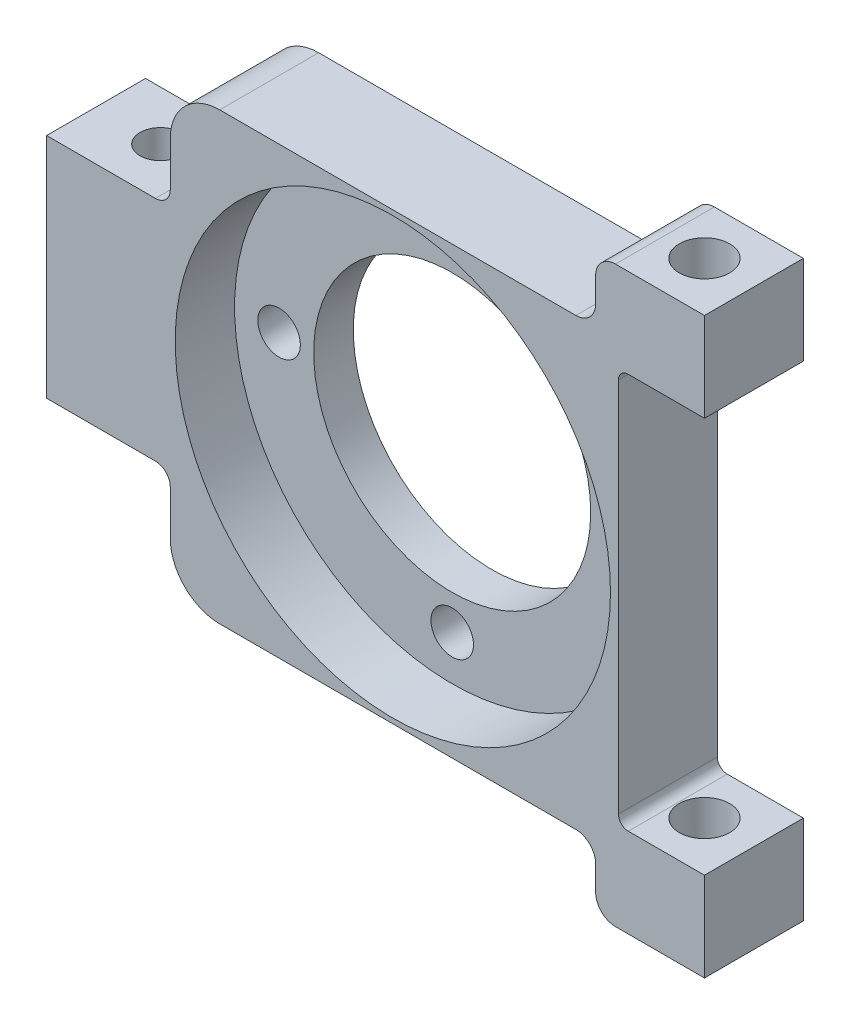
ISO-10303-21;
HEADER;
FILE_DESCRIPTION(('STEP AP214'),'2;1');
FILE_NAME('part.step','',(''),(''),'','','');
FILE_SCHEMA(('AUTOMOTIVE_DESIGN { 1 0 10303 214 1 1 1 1 }'));
ENDSEC;
DATA;
#1=APPLICATION_CONTEXT('core data for automotive mechanical design processes');
#2=APPLICATION_PROTOCOL_DEFINITION('international standard','automotive_design',2000,#1);
#3=PRODUCT_CONTEXT('',#1,'mechanical');
#4=PRODUCT('Part','Part','',(#3));
#5=PRODUCT_RELATED_PRODUCT_CATEGORY('part','',(#4));
#6=PRODUCT_DEFINITION_FORMATION('','',#4);
#7=PRODUCT_DEFINITION_CONTEXT('part definition',#1,'design');
#8=PRODUCT_DEFINITION('design','',#6,#7);
#9=PRODUCT_DEFINITION_SHAPE('','',#8);
#10=(LENGTH_UNIT() NAMED_UNIT(*) SI_UNIT(.MILLI.,.METRE.));
#11=(NAMED_UNIT(*) PLANE_ANGLE_UNIT() SI_UNIT($,.RADIAN.));
#12=(NAMED_UNIT(*) SI_UNIT($,.STERADIAN.) SOLID_ANGLE_UNIT());
#13=UNCERTAINTY_MEASURE_WITH_UNIT(LENGTH_MEASURE(1.E-05),#10,'distance_accuracy_value','');
#14=(GEOMETRIC_REPRESENTATION_CONTEXT(3) GLOBAL_UNCERTAINTY_ASSIGNED_CONTEXT((#13)) GLOBAL_UNIT_ASSIGNED_CONTEXT((#10,
#11,#12)) REPRESENTATION_CONTEXT('',''));
#15=CARTESIAN_POINT('',(0.,0.,0.));
#16=DIRECTION('',(0.,0.,1.));
#17=DIRECTION('',(1.,0.,0.));
#18=AXIS2_PLACEMENT_3D('',#15,#16,#17);
#19=CARTESIAN_POINT('',(26.5,-29.,5.));
#20=DIRECTION('',(0.,1.,0.));
#21=DIRECTION('',(0.,0.,1.));
#22=AXIS2_PLACEMENT_3D('',#19,#20,#21);
#23=CYLINDRICAL_SURFACE('',#22,2.55);
#24=CARTESIAN_POINT('',(26.5,-20.,5.));
#25=DIRECTION('',(0.,-1.,0.));
#26=DIRECTION('',(0.,0.,-1.));
#27=AXIS2_PLACEMENT_3D('',#24,#25,#26);
#28=CIRCLE('',#27,2.55);
#29=CARTESIAN_POINT('',(26.5,-20.,2.45));
#30=VERTEX_POINT('',#29);
#31=EDGE_CURVE('E476',#30,#30,#28,.F.);
#32=ORIENTED_EDGE('',*,*,#31,.T.);
#33=EDGE_LOOP('',(#32));
#34=FACE_BOUND('',#33,.T.);
#35=CARTESIAN_POINT('',(26.5,-29.,5.));
#36=DIRECTION('',(0.,1.,0.));
#37=DIRECTION('',(0.,0.,1.));
#38=AXIS2_PLACEMENT_3D('',#35,#36,#37);
#39=CIRCLE('',#38,2.55);
#40=CARTESIAN_POINT('',(26.5,-29.,7.55));
#41=VERTEX_POINT('',#40);
#42=EDGE_CURVE('E280',#41,#41,#39,.T.);
#43=ORIENTED_EDGE('',*,*,#42,.F.);
#44=EDGE_LOOP('',(#43));
#45=FACE_BOUND('',#44,.T.);
#46=ADVANCED_FACE('F39',(#34,#45),#23,.F.);
#47=CARTESIAN_POINT('',(31.5,-29.,0.));
#48=DIRECTION('',(-1.,0.,0.));
#49=DIRECTION('',(0.,0.,1.));
#50=AXIS2_PLACEMENT_3D('',#47,#48,#49);
#51=PLANE('',#50);
#52=DIRECTION('',(0.,1.,0.));
#53=VECTOR('',#52,1.);
#54=CARTESIAN_POINT('',(31.5,-29.,0.));
#55=LINE('',#54,#53);
#56=CARTESIAN_POINT('',(31.5,-29.,0.));
#57=VERTEX_POINT('',#56);
#58=CARTESIAN_POINT('',(31.5,-20.,0.));
#59=VERTEX_POINT('',#58);
#60=EDGE_CURVE('E218',#57,#59,#55,.T.);
#61=ORIENTED_EDGE('',*,*,#60,.T.);
#62=DIRECTION('',(0.,0.,1.));
#63=VECTOR('',#62,1.);
#64=CARTESIAN_POINT('',(31.5,-20.,0.));
#65=LINE('',#64,#63);
#66=CARTESIAN_POINT('',(31.5,-20.,10.));
#67=VERTEX_POINT('',#66);
#68=EDGE_CURVE('E229',#59,#67,#65,.T.);
#69=ORIENTED_EDGE('',*,*,#68,.T.);
#70=DIRECTION('',(0.,1.,0.));
#71=VECTOR('',#70,1.);
#72=CARTESIAN_POINT('',(31.5,-29.,10.));
#73=LINE('',#72,#71);
#74=CARTESIAN_POINT('',(31.5,-29.,10.));
#75=VERTEX_POINT('',#74);
#76=EDGE_CURVE('E247',#75,#67,#73,.T.);
#77=ORIENTED_EDGE('',*,*,#76,.F.);
#78=DIRECTION('',(0.,0.,1.));
#79=VECTOR('',#78,1.);
#80=CARTESIAN_POINT('',(31.5,-29.,0.));
#81=LINE('',#80,#79);
#82=EDGE_CURVE('E243',#57,#75,#81,.T.);
#83=ORIENTED_EDGE('',*,*,#82,.F.);
#84=EDGE_LOOP('',(#61,#69,#77,#83));
#85=FACE_BOUND('',#84,.T.);
#86=ADVANCED_FACE('F241',(#85),#51,.F.);
#87=CARTESIAN_POINT('',(17.5,0.,10.));
#88=DIRECTION('',(0.,0.,-1.));
#89=DIRECTION('',(-1.,0.,0.));
#90=AXIS2_PLACEMENT_3D('',#87,#88,#89);
#91=CYLINDRICAL_SURFACE('',#90,2.15);
#92=CARTESIAN_POINT('',(17.5,0.,0.));
#93=DIRECTION('',(0.,0.,1.));
#94=DIRECTION('',(1.,0.,0.));
#95=AXIS2_PLACEMENT_3D('',#92,#93,#94);
#96=CIRCLE('',#95,2.15);
#97=CARTESIAN_POINT('',(19.65,0.,0.));
#98=VERTEX_POINT('',#97);
#99=EDGE_CURVE('E318',#98,#98,#96,.T.);
#100=ORIENTED_EDGE('',*,*,#99,.F.);
#101=EDGE_LOOP('',(#100));
#102=FACE_BOUND('',#101,.T.);
#103=CARTESIAN_POINT('',(17.5,0.,4.));
#104=DIRECTION('',(0.,0.,1.));
#105=DIRECTION('',(1.,0.,0.));
#106=AXIS2_PLACEMENT_3D('',#103,#104,#105);
#107=CIRCLE('',#106,2.15);
#108=CARTESIAN_POINT('',(19.65,0.,4.));
#109=VERTEX_POINT('',#108);
#110=EDGE_CURVE('E303',#109,#109,#107,.T.);
#111=ORIENTED_EDGE('',*,*,#110,.T.);
#112=EDGE_LOOP('',(#111));
#113=FACE_BOUND('',#112,.T.);
#114=ADVANCED_FACE('F512',(#102,#113),#91,.F.);
#115=CARTESIAN_POINT('',(0.,0.,10.));
#116=DIRECTION('',(0.,0.,-1.));
#117=DIRECTION('',(-1.,0.,0.));
#118=AXIS2_PLACEMENT_3D('',#115,#116,#117);
#119=CYLINDRICAL_SURFACE('',#118,14.);
#120=CARTESIAN_POINT('',(0.,0.,0.));
#121=DIRECTION('',(0.,0.,1.));
#122=DIRECTION('',(1.,0.,0.));
#123=AXIS2_PLACEMENT_3D('',#120,#121,#122);
#124=CIRCLE('',#123,14.);
#125=CARTESIAN_POINT('',(14.,0.,0.));
#126=VERTEX_POINT('',#125);
#127=EDGE_CURVE('E315',#126,#126,#124,.T.);
#128=ORIENTED_EDGE('',*,*,#127,.F.);
#129=EDGE_LOOP('',(#128));
#130=FACE_BOUND('',#129,.T.);
#131=CARTESIAN_POINT('',(0.,0.,4.));
#132=DIRECTION('',(0.,0.,1.));
#133=DIRECTION('',(1.,0.,0.));
#134=AXIS2_PLACEMENT_3D('',#131,#132,#133);
#135=CIRCLE('',#134,14.);
#136=CARTESIAN_POINT('',(14.,0.,4.));
#137=VERTEX_POINT('',#136);
#138=EDGE_CURVE('E300',#137,#137,#135,.T.);
#139=ORIENTED_EDGE('',*,*,#138,.T.);
#140=EDGE_LOOP('',(#139));
#141=FACE_BOUND('',#140,.T.);
#142=ADVANCED_FACE('F866',(#130,#141),#119,.F.);
#143=CARTESIAN_POINT('',(0.,-17.5,10.));
#144=DIRECTION('',(0.,0.,-1.));
#145=DIRECTION('',(-1.,0.,0.));
#146=AXIS2_PLACEMENT_3D('',#143,#144,#145);
#147=CYLINDRICAL_SURFACE('',#146,2.15);
#148=CARTESIAN_POINT('',(0.,-17.5,0.));
#149=DIRECTION('',(0.,0.,1.));
#150=DIRECTION('',(1.,0.,0.));
#151=AXIS2_PLACEMENT_3D('',#148,#149,#150);
#152=CIRCLE('',#151,2.15);
#153=CARTESIAN_POINT('',(2.15,-17.5,0.));
#154=VERTEX_POINT('',#153);
#155=EDGE_CURVE('E312',#154,#154,#152,.T.);
#156=ORIENTED_EDGE('',*,*,#155,.F.);
#157=EDGE_LOOP('',(#156));
#158=FACE_BOUND('',#157,.T.);
#159=CARTESIAN_POINT('',(0.,-17.5,4.));
#160=DIRECTION('',(0.,0.,1.));
#161=DIRECTION('',(1.,0.,0.));
#162=AXIS2_PLACEMENT_3D('',#159,#160,#161);
#163=CIRCLE('',#162,2.15);
#164=CARTESIAN_POINT('',(2.15,-17.5,4.));
#165=VERTEX_POINT('',#164);
#166=EDGE_CURVE('E297',#165,#165,#163,.T.);
#167=ORIENTED_EDGE('',*,*,#166,.T.);
#168=EDGE_LOOP('',(#167));
#169=FACE_BOUND('',#168,.T.);
#170=ADVANCED_FACE('F856',(#158,#169),#147,.F.);
#171=CARTESIAN_POINT('',(-17.5,0.,10.));
#172=DIRECTION('',(0.,0.,-1.));
#173=DIRECTION('',(-1.,0.,0.));
#174=AXIS2_PLACEMENT_3D('',#171,#172,#173);
#175=CYLINDRICAL_SURFACE('',#174,2.15);
#176=CARTESIAN_POINT('',(-17.5,0.,0.));
#177=DIRECTION('',(0.,0.,1.));
#178=DIRECTION('',(1.,0.,0.));
#179=AXIS2_PLACEMENT_3D('',#176,#177,#178);
#180=CIRCLE('',#179,2.15);
#181=CARTESIAN_POINT('',(-15.35,0.,0.));
#182=VERTEX_POINT('',#181);
#183=EDGE_CURVE('E309',#182,#182,#180,.T.);
#184=ORIENTED_EDGE('',*,*,#183,.F.);
#185=EDGE_LOOP('',(#184));
#186=FACE_BOUND('',#185,.T.);
#187=CARTESIAN_POINT('',(-17.5,0.,4.));
#188=DIRECTION('',(0.,0.,1.));
#189=DIRECTION('',(1.,0.,0.));
#190=AXIS2_PLACEMENT_3D('',#187,#188,#189);
#191=CIRCLE('',#190,2.15);
#192=CARTESIAN_POINT('',(-15.35,0.,4.));
#193=VERTEX_POINT('',#192);
#194=EDGE_CURVE('E294',#193,#193,#191,.T.);
#195=ORIENTED_EDGE('',*,*,#194,.T.);
#196=EDGE_LOOP('',(#195));
#197=FACE_BOUND('',#196,.T.);
#198=ADVANCED_FACE('F846',(#186,#197),#175,.F.);
#199=CARTESIAN_POINT('',(0.,17.5,10.));
#200=DIRECTION('',(0.,0.,-1.));
#201=DIRECTION('',(-1.,0.,0.));
#202=AXIS2_PLACEMENT_3D('',#199,#200,#201);
#203=CYLINDRICAL_SURFACE('',#202,2.15);
#204=CARTESIAN_POINT('',(0.,17.5,0.));
#205=DIRECTION('',(0.,0.,1.));
#206=DIRECTION('',(1.,0.,0.));
#207=AXIS2_PLACEMENT_3D('',#204,#205,#206);
#208=CIRCLE('',#207,2.15);
#209=CARTESIAN_POINT('',(2.15000000000001,17.5,0.));
#210=VERTEX_POINT('',#209);
#211=EDGE_CURVE('E306',#210,#210,#208,.T.);
#212=ORIENTED_EDGE('',*,*,#211,.F.);
#213=EDGE_LOOP('',(#212));
#214=FACE_BOUND('',#213,.T.);
#215=CARTESIAN_POINT('',(0.,17.5,4.));
#216=DIRECTION('',(0.,0.,1.));
#217=DIRECTION('',(1.,0.,0.));
#218=AXIS2_PLACEMENT_3D('',#215,#216,#217);
#219=CIRCLE('',#218,2.15);
#220=CARTESIAN_POINT('',(2.15000000000001,17.5,4.));
#221=VERTEX_POINT('',#220);
#222=EDGE_CURVE('E291',#221,#221,#219,.T.);
#223=ORIENTED_EDGE('',*,*,#222,.T.);
#224=EDGE_LOOP('',(#223));
#225=FACE_BOUND('',#224,.T.);
#226=ADVANCED_FACE('F699',(#214,#225),#203,.F.);
#227=CARTESIAN_POINT('',(0.,0.,10.));
#228=DIRECTION('',(0.,0.,1.));
#229=DIRECTION('',(1.,0.,0.));
#230=AXIS2_PLACEMENT_3D('',#227,#228,#229);
#231=PLANE('',#230);
#232=DIRECTION('',(-1.,0.,0.));
#233=VECTOR('',#232,1.);
#234=CARTESIAN_POINT('',(-35.,29.,10.));
#235=LINE('',#234,#233);
#236=CARTESIAN_POINT('',(31.5,29.,10.));
#237=VERTEX_POINT('',#236);
#238=CARTESIAN_POINT('',(22.5,29.,10.));
#239=VERTEX_POINT('',#238);
#240=EDGE_CURVE('E322',#237,#239,#235,.T.);
#241=ORIENTED_EDGE('',*,*,#240,.T.);
#242=CARTESIAN_POINT('',(22.5,27.,10.));
#243=DIRECTION('',(0.,0.,1.));
#244=DIRECTION('',(1.,0.,0.));
#245=AXIS2_PLACEMENT_3D('',#242,#243,#244);
#246=CIRCLE('',#245,2.);
#247=CARTESIAN_POINT('',(20.5,27.,10.));
#248=VERTEX_POINT('',#247);
#249=EDGE_CURVE('E404',#239,#248,#246,.T.);
#250=ORIENTED_EDGE('',*,*,#249,.T.);
#251=DIRECTION('',(0.,1.,0.));
#252=VECTOR('',#251,1.);
#253=CARTESIAN_POINT('',(20.5,22.5,10.));
#254=LINE('',#253,#252);
#255=CARTESIAN_POINT('',(20.5,24.5,10.));
#256=VERTEX_POINT('',#255);
#257=EDGE_CURVE('E460',#256,#248,#254,.T.);
#258=ORIENTED_EDGE('',*,*,#257,.F.);
#259=CARTESIAN_POINT('',(18.5,24.5,10.));
#260=DIRECTION('',(0.,0.,1.));
#261=DIRECTION('',(1.,0.,0.));
#262=AXIS2_PLACEMENT_3D('',#259,#260,#261);
#263=CIRCLE('',#262,2.);
#264=CARTESIAN_POINT('',(18.5,22.5,10.));
#265=VERTEX_POINT('',#264);
#266=EDGE_CURVE('E426',#256,#265,#263,.F.);
#267=ORIENTED_EDGE('',*,*,#266,.T.);
#268=DIRECTION('',(1.,0.,0.));
#269=VECTOR('',#268,1.);
#270=CARTESIAN_POINT('',(-22.5,22.5,10.));
#271=LINE('',#270,#269);
#272=CARTESIAN_POINT('',(-17.5,22.5,10.));
#273=VERTEX_POINT('',#272);
#274=EDGE_CURVE('E457',#273,#265,#271,.T.);
#275=ORIENTED_EDGE('',*,*,#274,.F.);
#276=CARTESIAN_POINT('',(-17.5,17.5,10.));
#277=DIRECTION('',(0.,0.,1.));
#278=DIRECTION('',(1.,0.,0.));
#279=AXIS2_PLACEMENT_3D('',#276,#277,#278);
#280=CIRCLE('',#279,5.);
#281=CARTESIAN_POINT('',(-22.5,17.5,10.));
#282=VERTEX_POINT('',#281);
#283=EDGE_CURVE('E385',#273,#282,#280,.T.);
#284=ORIENTED_EDGE('',*,*,#283,.T.);
#285=DIRECTION('',(0.,-1.,0.));
#286=VECTOR('',#285,1.);
#287=CARTESIAN_POINT('',(-22.5,29.,10.));
#288=LINE('',#287,#286);
#289=CARTESIAN_POINT('',(-22.5,13.,10.));
#290=VERTEX_POINT('',#289);
#291=EDGE_CURVE('E255',#282,#290,#288,.T.);
#292=ORIENTED_EDGE('',*,*,#291,.T.);
#293=CARTESIAN_POINT('',(-24.,13.,10.));
#294=DIRECTION('',(0.,0.,1.));
#295=DIRECTION('',(1.,0.,0.));
#296=AXIS2_PLACEMENT_3D('',#293,#294,#295);
#297=CIRCLE('',#296,1.5);
#298=CARTESIAN_POINT('',(-24.,11.5,10.));
#299=VERTEX_POINT('',#298);
#300=EDGE_CURVE('E361',#290,#299,#297,.F.);
#301=ORIENTED_EDGE('',*,*,#300,.T.);
#302=DIRECTION('',(-1.,0.,0.));
#303=VECTOR('',#302,1.);
#304=CARTESIAN_POINT('',(-22.5,11.5,10.));
#305=LINE('',#304,#303);
#306=CARTESIAN_POINT('',(-35.,11.5,10.));
#307=VERTEX_POINT('',#306);
#308=EDGE_CURVE('E257',#299,#307,#305,.T.);
#309=ORIENTED_EDGE('',*,*,#308,.T.);
#310=DIRECTION('',(0.,-1.,0.));
#311=VECTOR('',#310,1.);
#312=CARTESIAN_POINT('',(-35.,29.,10.));
#313=LINE('',#312,#311);
#314=CARTESIAN_POINT('',(-35.,-11.5,10.));
#315=VERTEX_POINT('',#314);
#316=EDGE_CURVE('E325',#307,#315,#313,.T.);
#317=ORIENTED_EDGE('',*,*,#316,.T.);
#318=DIRECTION('',(1.,0.,0.));
#319=VECTOR('',#318,1.);
#320=CARTESIAN_POINT('',(-22.5,-11.5,10.));
#321=LINE('',#320,#319);
#322=CARTESIAN_POINT('',(-24.,-11.5,10.));
#323=VERTEX_POINT('',#322);
#324=EDGE_CURVE('E268',#315,#323,#321,.T.);
#325=ORIENTED_EDGE('',*,*,#324,.T.);
#326=CARTESIAN_POINT('',(-24.,-13.,10.));
#327=DIRECTION('',(0.,0.,1.));
#328=DIRECTION('',(1.,0.,0.));
#329=AXIS2_PLACEMENT_3D('',#326,#327,#328);
#330=CIRCLE('',#329,1.5);
#331=CARTESIAN_POINT('',(-22.5,-13.,10.));
#332=VERTEX_POINT('',#331);
#333=EDGE_CURVE('E356',#323,#332,#330,.F.);
#334=ORIENTED_EDGE('',*,*,#333,.T.);
#335=DIRECTION('',(0.,-1.,0.));
#336=VECTOR('',#335,1.);
#337=CARTESIAN_POINT('',(-22.5,-29.,10.));
#338=LINE('',#337,#336);
#339=CARTESIAN_POINT('',(-22.5,-17.5,10.));
#340=VERTEX_POINT('',#339);
#341=EDGE_CURVE('E271',#332,#340,#338,.T.);
#342=ORIENTED_EDGE('',*,*,#341,.T.);
#343=CARTESIAN_POINT('',(-17.5,-17.5,10.));
#344=DIRECTION('',(0.,0.,1.));
#345=DIRECTION('',(1.,0.,0.));
#346=AXIS2_PLACEMENT_3D('',#343,#344,#345);
#347=CIRCLE('',#346,5.);
#348=CARTESIAN_POINT('',(-17.5,-22.5,10.));
#349=VERTEX_POINT('',#348);
#350=EDGE_CURVE('E382',#340,#349,#347,.T.);
#351=ORIENTED_EDGE('',*,*,#350,.T.);
#352=DIRECTION('',(-1.,0.,0.));
#353=VECTOR('',#352,1.);
#354=CARTESIAN_POINT('',(-22.5,-22.5,10.));
#355=LINE('',#354,#353);
#356=CARTESIAN_POINT('',(18.5,-22.5,10.));
#357=VERTEX_POINT('',#356);
#358=EDGE_CURVE('E435',#357,#349,#355,.T.);
#359=ORIENTED_EDGE('',*,*,#358,.F.);
#360=CARTESIAN_POINT('',(18.5,-24.5,10.));
#361=DIRECTION('',(0.,0.,1.));
#362=DIRECTION('',(1.,0.,0.));
#363=AXIS2_PLACEMENT_3D('',#360,#361,#362);
#364=CIRCLE('',#363,2.);
#365=CARTESIAN_POINT('',(20.5,-24.5,10.));
#366=VERTEX_POINT('',#365);
#367=EDGE_CURVE('E47',#357,#366,#364,.F.);
#368=ORIENTED_EDGE('',*,*,#367,.T.);
#369=DIRECTION('',(0.,1.,0.));
#370=VECTOR('',#369,1.);
#371=CARTESIAN_POINT('',(20.5,-22.5,10.));
#372=LINE('',#371,#370);
#373=CARTESIAN_POINT('',(20.5,-27.,10.));
#374=VERTEX_POINT('',#373);
#375=EDGE_CURVE('E434',#374,#366,#372,.T.);
#376=ORIENTED_EDGE('',*,*,#375,.F.);
#377=CARTESIAN_POINT('',(22.5,-27.,10.));
#378=DIRECTION('',(0.,0.,1.));
#379=DIRECTION('',(1.,0.,0.));
#380=AXIS2_PLACEMENT_3D('',#377,#378,#379);
#381=CIRCLE('',#380,2.);
#382=CARTESIAN_POINT('',(22.5,-29.,10.));
#383=VERTEX_POINT('',#382);
#384=EDGE_CURVE('E402',#374,#383,#381,.T.);
#385=ORIENTED_EDGE('',*,*,#384,.T.);
#386=DIRECTION('',(1.,0.,0.));
#387=VECTOR('',#386,1.);
#388=CARTESIAN_POINT('',(-35.,-29.,10.));
#389=LINE('',#388,#387);
#390=EDGE_CURVE('E329',#383,#75,#389,.T.);
#391=ORIENTED_EDGE('',*,*,#390,.T.);
#392=ORIENTED_EDGE('',*,*,#76,.T.);
#393=DIRECTION('',(1.,0.,0.));
#394=VECTOR('',#393,1.);
#395=CARTESIAN_POINT('',(31.5,-20.,10.));
#396=LINE('',#395,#394);
#397=CARTESIAN_POINT('',(23.8,-20.,10.));
#398=VERTEX_POINT('',#397);
#399=EDGE_CURVE('E233',#398,#67,#396,.T.);
#400=ORIENTED_EDGE('',*,*,#399,.F.);
#401=CARTESIAN_POINT('',(23.8,-19.,10.));
#402=DIRECTION('',(0.,0.,1.));
#403=DIRECTION('',(1.,0.,0.));
#404=AXIS2_PLACEMENT_3D('',#401,#402,#403);
#405=CIRCLE('',#404,1.);
#406=CARTESIAN_POINT('',(22.8,-19.,10.));
#407=VERTEX_POINT('',#406);
#408=EDGE_CURVE('E372',#398,#407,#405,.F.);
#409=ORIENTED_EDGE('',*,*,#408,.T.);
#410=DIRECTION('',(0.,-1.,0.));
#411=VECTOR('',#410,1.);
#412=CARTESIAN_POINT('',(22.8,-20.,10.));
#413=LINE('',#412,#411);
#414=CARTESIAN_POINT('',(22.8,19.,10.));
#415=VERTEX_POINT('',#414);
#416=EDGE_CURVE('E226',#415,#407,#413,.T.);
#417=ORIENTED_EDGE('',*,*,#416,.F.);
#418=CARTESIAN_POINT('',(23.8,19.,10.));
#419=DIRECTION('',(0.,0.,1.));
#420=DIRECTION('',(1.,0.,0.));
#421=AXIS2_PLACEMENT_3D('',#418,#419,#420);
#422=CIRCLE('',#421,1.);
#423=CARTESIAN_POINT('',(23.8,20.,10.));
#424=VERTEX_POINT('',#423);
#425=EDGE_CURVE('E375',#415,#424,#422,.F.);
#426=ORIENTED_EDGE('',*,*,#425,.T.);
#427=DIRECTION('',(-1.,0.,0.));
#428=VECTOR('',#427,1.);
#429=CARTESIAN_POINT('',(31.5,20.,10.));
#430=LINE('',#429,#428);
#431=CARTESIAN_POINT('',(31.5,20.,10.));
#432=VERTEX_POINT('',#431);
#433=EDGE_CURVE('E450',#432,#424,#430,.T.);
#434=ORIENTED_EDGE('',*,*,#433,.F.);
#435=EDGE_CURVE('E244',#432,#237,#73,.T.);
#436=ORIENTED_EDGE('',*,*,#435,.T.);
#437=EDGE_LOOP('',(#241,#250,#258,#267,#275,#284,#292,#301,#309,#317,#325,#334,#342,#351,#359,
#368,#376,#385,#391,#392,#400,#409,#417,#426,#434,#436));
#438=FACE_BOUND('',#437,.T.);
#439=CARTESIAN_POINT('',(0.,0.,10.));
#440=DIRECTION('',(0.,0.,1.));
#441=DIRECTION('',(1.,0.,0.));
#442=AXIS2_PLACEMENT_3D('',#439,#440,#441);
#443=CIRCLE('',#442,22.);
#444=CARTESIAN_POINT('',(22.,0.,10.));
#445=VERTEX_POINT('',#444);
#446=EDGE_CURVE('E287',#445,#445,#443,.T.);
#447=ORIENTED_EDGE('',*,*,#446,.F.);
#448=EDGE_LOOP('',(#447));
#449=FACE_BOUND('',#448,.T.);
#450=ADVANCED_FACE('F432',(#438,#449),#231,.T.);
#451=CARTESIAN_POINT('',(0.,0.,0.));
#452=DIRECTION('',(0.,0.,1.));
#453=DIRECTION('',(1.,0.,0.));
#454=AXIS2_PLACEMENT_3D('',#451,#452,#453);
#455=PLANE('',#454);
#456=DIRECTION('',(0.,1.,0.));
#457=VECTOR('',#456,1.);
#458=CARTESIAN_POINT('',(20.5,22.5,0.));
#459=LINE('',#458,#457);
#460=CARTESIAN_POINT('',(20.5,24.5,0.));
#461=VERTEX_POINT('',#460);
#462=CARTESIAN_POINT('',(20.5,27.,0.));
#463=VERTEX_POINT('',#462);
#464=EDGE_CURVE('E455',#461,#463,#459,.T.);
#465=ORIENTED_EDGE('',*,*,#464,.T.);
#466=CARTESIAN_POINT('',(22.5,27.,0.));
#467=DIRECTION('',(0.,0.,1.));
#468=DIRECTION('',(1.,0.,0.));
#469=AXIS2_PLACEMENT_3D('',#466,#467,#468);
#470=CIRCLE('',#469,2.);
#471=CARTESIAN_POINT('',(22.5,29.,0.));
#472=VERTEX_POINT('',#471);
#473=EDGE_CURVE('E413',#463,#472,#470,.F.);
#474=ORIENTED_EDGE('',*,*,#473,.T.);
#475=DIRECTION('',(-1.,0.,0.));
#476=VECTOR('',#475,1.);
#477=CARTESIAN_POINT('',(-35.,29.,0.));
#478=LINE('',#477,#476);
#479=CARTESIAN_POINT('',(31.5,29.,0.));
#480=VERTEX_POINT('',#479);
#481=EDGE_CURVE('E321',#480,#472,#478,.T.);
#482=ORIENTED_EDGE('',*,*,#481,.F.);
#483=CARTESIAN_POINT('',(31.5,20.,0.));
#484=VERTEX_POINT('',#483);
#485=EDGE_CURVE('E245',#484,#480,#55,.T.);
#486=ORIENTED_EDGE('',*,*,#485,.F.);
#487=DIRECTION('',(-1.,0.,0.));
#488=VECTOR('',#487,1.);
#489=CARTESIAN_POINT('',(31.5,20.,0.));
#490=LINE('',#489,#488);
#491=CARTESIAN_POINT('',(23.8,20.,0.));
#492=VERTEX_POINT('',#491);
#493=EDGE_CURVE('E225',#484,#492,#490,.T.);
#494=ORIENTED_EDGE('',*,*,#493,.T.);
#495=CARTESIAN_POINT('',(23.8,19.,0.));
#496=DIRECTION('',(0.,0.,1.));
#497=DIRECTION('',(1.,0.,0.));
#498=AXIS2_PLACEMENT_3D('',#495,#496,#497);
#499=CIRCLE('',#498,1.);
#500=CARTESIAN_POINT('',(22.8,19.,0.));
#501=VERTEX_POINT('',#500);
#502=EDGE_CURVE('E377',#492,#501,#499,.T.);
#503=ORIENTED_EDGE('',*,*,#502,.T.);
#504=DIRECTION('',(0.,-1.,0.));
#505=VECTOR('',#504,1.);
#506=CARTESIAN_POINT('',(22.8,-20.,0.));
#507=LINE('',#506,#505);
#508=CARTESIAN_POINT('',(22.8,-19.,0.));
#509=VERTEX_POINT('',#508);
#510=EDGE_CURVE('E238',#501,#509,#507,.T.);
#511=ORIENTED_EDGE('',*,*,#510,.T.);
#512=CARTESIAN_POINT('',(23.8,-19.,0.));
#513=DIRECTION('',(0.,0.,1.));
#514=DIRECTION('',(1.,0.,0.));
#515=AXIS2_PLACEMENT_3D('',#512,#513,#514);
#516=CIRCLE('',#515,1.);
#517=CARTESIAN_POINT('',(23.8,-20.,0.));
#518=VERTEX_POINT('',#517);
#519=EDGE_CURVE('E221',#509,#518,#516,.T.);
#520=ORIENTED_EDGE('',*,*,#519,.T.);
#521=DIRECTION('',(1.,0.,0.));
#522=VECTOR('',#521,1.);
#523=CARTESIAN_POINT('',(31.5,-20.,0.));
#524=LINE('',#523,#522);
#525=EDGE_CURVE('E211',#518,#59,#524,.T.);
#526=ORIENTED_EDGE('',*,*,#525,.T.);
#527=ORIENTED_EDGE('',*,*,#60,.F.);
#528=DIRECTION('',(1.,0.,0.));
#529=VECTOR('',#528,1.);
#530=CARTESIAN_POINT('',(-35.,-29.,0.));
#531=LINE('',#530,#529);
#532=CARTESIAN_POINT('',(22.5,-29.,0.));
#533=VERTEX_POINT('',#532);
#534=EDGE_CURVE('E326',#533,#57,#531,.T.);
#535=ORIENTED_EDGE('',*,*,#534,.F.);
#536=CARTESIAN_POINT('',(22.5,-27.,0.));
#537=DIRECTION('',(0.,0.,1.));
#538=DIRECTION('',(1.,0.,0.));
#539=AXIS2_PLACEMENT_3D('',#536,#537,#538);
#540=CIRCLE('',#539,2.);
#541=CARTESIAN_POINT('',(20.5,-27.,0.));
#542=VERTEX_POINT('',#541);
#543=EDGE_CURVE('E411',#533,#542,#540,.F.);
#544=ORIENTED_EDGE('',*,*,#543,.T.);
#545=DIRECTION('',(0.,1.,0.));
#546=VECTOR('',#545,1.);
#547=CARTESIAN_POINT('',(20.5,-22.5,0.));
#548=LINE('',#547,#546);
#549=CARTESIAN_POINT('',(20.5,-24.5,0.));
#550=VERTEX_POINT('',#549);
#551=EDGE_CURVE('E448',#542,#550,#548,.T.);
#552=ORIENTED_EDGE('',*,*,#551,.T.);
#553=CARTESIAN_POINT('',(18.5,-24.5,0.));
#554=DIRECTION('',(0.,0.,1.));
#555=DIRECTION('',(1.,0.,0.));
#556=AXIS2_PLACEMENT_3D('',#553,#554,#555);
#557=CIRCLE('',#556,2.);
#558=CARTESIAN_POINT('',(18.5,-22.5,0.));
#559=VERTEX_POINT('',#558);
#560=EDGE_CURVE('E11',#550,#559,#557,.T.);
#561=ORIENTED_EDGE('',*,*,#560,.T.);
#562=DIRECTION('',(-1.,0.,0.));
#563=VECTOR('',#562,1.);
#564=CARTESIAN_POINT('',(-22.5,-22.5,0.));
#565=LINE('',#564,#563);
#566=CARTESIAN_POINT('',(-17.5,-22.5,0.));
#567=VERTEX_POINT('',#566);
#568=EDGE_CURVE('E445',#559,#567,#565,.T.);
#569=ORIENTED_EDGE('',*,*,#568,.T.);
#570=CARTESIAN_POINT('',(-17.5,-17.5,0.));
#571=DIRECTION('',(0.,0.,1.));
#572=DIRECTION('',(1.,0.,0.));
#573=AXIS2_PLACEMENT_3D('',#570,#571,#572);
#574=CIRCLE('',#573,5.);
#575=CARTESIAN_POINT('',(-22.5,-17.5,0.));
#576=VERTEX_POINT('',#575);
#577=EDGE_CURVE('E389',#567,#576,#574,.F.);
#578=ORIENTED_EDGE('',*,*,#577,.T.);
#579=DIRECTION('',(0.,-1.,0.));
#580=VECTOR('',#579,1.);
#581=CARTESIAN_POINT('',(-22.5,-29.,0.));
#582=LINE('',#581,#580);
#583=CARTESIAN_POINT('',(-22.5,-13.,0.));
#584=VERTEX_POINT('',#583);
#585=EDGE_CURVE('E272',#584,#576,#582,.T.);
#586=ORIENTED_EDGE('',*,*,#585,.F.);
#587=CARTESIAN_POINT('',(-24.,-13.,0.));
#588=DIRECTION('',(0.,0.,1.));
#589=DIRECTION('',(1.,0.,0.));
#590=AXIS2_PLACEMENT_3D('',#587,#588,#589);
#591=CIRCLE('',#590,1.5);
#592=CARTESIAN_POINT('',(-24.,-11.5,0.));
#593=VERTEX_POINT('',#592);
#594=EDGE_CURVE('E354',#584,#593,#591,.T.);
#595=ORIENTED_EDGE('',*,*,#594,.T.);
#596=DIRECTION('',(1.,0.,0.));
#597=VECTOR('',#596,1.);
#598=CARTESIAN_POINT('',(-22.5,-11.5,0.));
#599=LINE('',#598,#597);
#600=CARTESIAN_POINT('',(-35.,-11.5,0.));
#601=VERTEX_POINT('',#600);
#602=EDGE_CURVE('E254',#601,#593,#599,.T.);
#603=ORIENTED_EDGE('',*,*,#602,.F.);
#604=DIRECTION('',(0.,-1.,0.));
#605=VECTOR('',#604,1.);
#606=CARTESIAN_POINT('',(-35.,29.,0.));
#607=LINE('',#606,#605);
#608=CARTESIAN_POINT('',(-35.,11.5,0.));
#609=VERTEX_POINT('',#608);
#610=EDGE_CURVE('E334',#609,#601,#607,.T.);
#611=ORIENTED_EDGE('',*,*,#610,.F.);
#612=DIRECTION('',(-1.,0.,0.));
#613=VECTOR('',#612,1.);
#614=CARTESIAN_POINT('',(-22.5,11.5,0.));
#615=LINE('',#614,#613);
#616=CARTESIAN_POINT('',(-24.,11.5,0.));
#617=VERTEX_POINT('',#616);
#618=EDGE_CURVE('E258',#617,#609,#615,.T.);
#619=ORIENTED_EDGE('',*,*,#618,.F.);
#620=CARTESIAN_POINT('',(-24.,13.,0.));
#621=DIRECTION('',(0.,0.,1.));
#622=DIRECTION('',(1.,0.,0.));
#623=AXIS2_PLACEMENT_3D('',#620,#621,#622);
#624=CIRCLE('',#623,1.5);
#625=CARTESIAN_POINT('',(-22.5,13.,0.));
#626=VERTEX_POINT('',#625);
#627=EDGE_CURVE('E358',#617,#626,#624,.T.);
#628=ORIENTED_EDGE('',*,*,#627,.T.);
#629=DIRECTION('',(0.,-1.,0.));
#630=VECTOR('',#629,1.);
#631=CARTESIAN_POINT('',(-22.5,29.,0.));
#632=LINE('',#631,#630);
#633=CARTESIAN_POINT('',(-22.5,17.5,0.));
#634=VERTEX_POINT('',#633);
#635=EDGE_CURVE('E261',#634,#626,#632,.T.);
#636=ORIENTED_EDGE('',*,*,#635,.F.);
#637=CARTESIAN_POINT('',(-17.5,17.5,0.));
#638=DIRECTION('',(0.,0.,1.));
#639=DIRECTION('',(1.,0.,0.));
#640=AXIS2_PLACEMENT_3D('',#637,#638,#639);
#641=CIRCLE('',#640,5.);
#642=CARTESIAN_POINT('',(-17.5,22.5,0.));
#643=VERTEX_POINT('',#642);
#644=EDGE_CURVE('E391',#634,#643,#641,.F.);
#645=ORIENTED_EDGE('',*,*,#644,.T.);
#646=DIRECTION('',(1.,0.,0.));
#647=VECTOR('',#646,1.);
#648=CARTESIAN_POINT('',(-22.5,22.5,0.));
#649=LINE('',#648,#647);
#650=CARTESIAN_POINT('',(18.5,22.5,0.));
#651=VERTEX_POINT('',#650);
#652=EDGE_CURVE('E440',#643,#651,#649,.T.);
#653=ORIENTED_EDGE('',*,*,#652,.T.);
#654=CARTESIAN_POINT('',(18.5,24.5,0.));
#655=DIRECTION('',(0.,0.,1.));
#656=DIRECTION('',(1.,0.,0.));
#657=AXIS2_PLACEMENT_3D('',#654,#655,#656);
#658=CIRCLE('',#657,2.);
#659=EDGE_CURVE('E428',#651,#461,#658,.T.);
#660=ORIENTED_EDGE('',*,*,#659,.T.);
#661=EDGE_LOOP('',(#465,#474,#482,#486,#494,#503,#511,#520,#526,#527,#535,#544,#552,#561,#569,
#578,#586,#595,#603,#611,#619,#628,#636,#645,#653,#660));
#662=FACE_BOUND('',#661,.T.);
#663=ORIENTED_EDGE('',*,*,#99,.T.);
#664=EDGE_LOOP('',(#663));
#665=FACE_BOUND('',#664,.T.);
#666=ORIENTED_EDGE('',*,*,#127,.T.);
#667=EDGE_LOOP('',(#666));
#668=FACE_BOUND('',#667,.T.);
#669=ORIENTED_EDGE('',*,*,#155,.T.);
#670=EDGE_LOOP('',(#669));
#671=FACE_BOUND('',#670,.T.);
#672=ORIENTED_EDGE('',*,*,#183,.T.);
#673=EDGE_LOOP('',(#672));
#674=FACE_BOUND('',#673,.T.);
#675=ORIENTED_EDGE('',*,*,#211,.T.);
#676=EDGE_LOOP('',(#675));
#677=FACE_BOUND('',#676,.T.);
#678=ADVANCED_FACE('F214',(#662,#665,#668,#671,#674,#677),#455,.F.);
#679=CARTESIAN_POINT('',(-35.,29.,10.));
#680=DIRECTION('',(0.,-1.,0.));
#681=DIRECTION('',(0.,0.,-1.));
#682=AXIS2_PLACEMENT_3D('',#679,#680,#681);
#683=PLANE('',#682);
#684=CARTESIAN_POINT('',(26.5,29.,5.));
#685=DIRECTION('',(0.,-1.,0.));
#686=DIRECTION('',(0.,0.,-1.));
#687=AXIS2_PLACEMENT_3D('',#684,#685,#686);
#688=CIRCLE('',#687,2.55);
#689=CARTESIAN_POINT('',(26.5,29.,2.45));
#690=VERTEX_POINT('',#689);
#691=EDGE_CURVE('E283',#690,#690,#688,.T.);
#692=ORIENTED_EDGE('',*,*,#691,.T.);
#693=EDGE_LOOP('',(#692));
#694=FACE_BOUND('',#693,.T.);
#695=ORIENTED_EDGE('',*,*,#481,.T.);
#696=DIRECTION('',(0.,0.,1.));
#697=VECTOR('',#696,1.);
#698=CARTESIAN_POINT('',(22.5,29.,10.));
#699=LINE('',#698,#697);
#700=EDGE_CURVE('E399',#472,#239,#699,.T.);
#701=ORIENTED_EDGE('',*,*,#700,.T.);
#702=ORIENTED_EDGE('',*,*,#240,.F.);
#703=DIRECTION('',(0.,0.,-1.));
#704=VECTOR('',#703,1.);
#705=CARTESIAN_POINT('',(31.5,29.,10.));
#706=LINE('',#705,#704);
#707=EDGE_CURVE('E251',#237,#480,#706,.T.);
#708=ORIENTED_EDGE('',*,*,#707,.T.);
#709=EDGE_LOOP('',(#695,#701,#702,#708));
#710=FACE_BOUND('',#709,.T.);
#711=ADVANCED_FACE('F535',(#694,#710),#683,.F.);
#712=CARTESIAN_POINT('',(-35.,29.,10.));
#713=DIRECTION('',(1.,0.,0.));
#714=DIRECTION('',(0.,0.,-1.));
#715=AXIS2_PLACEMENT_3D('',#712,#713,#714);
#716=PLANE('',#715);
#717=ORIENTED_EDGE('',*,*,#316,.F.);
#718=DIRECTION('',(0.,0.,-1.));
#719=VECTOR('',#718,1.);
#720=CARTESIAN_POINT('',(-35.,11.5,10.));
#721=LINE('',#720,#719);
#722=EDGE_CURVE('E260',#307,#609,#721,.T.);
#723=ORIENTED_EDGE('',*,*,#722,.T.);
#724=ORIENTED_EDGE('',*,*,#610,.T.);
#725=DIRECTION('',(0.,0.,-1.));
#726=VECTOR('',#725,1.);
#727=CARTESIAN_POINT('',(-35.,-11.5,10.));
#728=LINE('',#727,#726);
#729=EDGE_CURVE('E263',#315,#601,#728,.T.);
#730=ORIENTED_EDGE('',*,*,#729,.F.);
#731=EDGE_LOOP('',(#717,#723,#724,#730));
#732=FACE_BOUND('',#731,.T.);
#733=ADVANCED_FACE('F538',(#732),#716,.F.);
#734=CARTESIAN_POINT('',(-35.,-29.,10.));
#735=DIRECTION('',(0.,1.,0.));
#736=DIRECTION('',(0.,0.,1.));
#737=AXIS2_PLACEMENT_3D('',#734,#735,#736);
#738=PLANE('',#737);
#739=ORIENTED_EDGE('',*,*,#42,.T.);
#740=EDGE_LOOP('',(#739));
#741=FACE_BOUND('',#740,.T.);
#742=ORIENTED_EDGE('',*,*,#390,.F.);
#743=DIRECTION('',(0.,0.,1.));
#744=VECTOR('',#743,1.);
#745=CARTESIAN_POINT('',(22.5,-29.,10.));
#746=LINE('',#745,#744);
#747=EDGE_CURVE('E424',#383,#533,#746,.F.);
#748=ORIENTED_EDGE('',*,*,#747,.T.);
#749=ORIENTED_EDGE('',*,*,#534,.T.);
#750=ORIENTED_EDGE('',*,*,#82,.T.);
#751=EDGE_LOOP('',(#742,#748,#749,#750));
#752=FACE_BOUND('',#751,.T.);
#753=ADVANCED_FACE('F480',(#741,#752),#738,.F.);
#754=CARTESIAN_POINT('',(0.,0.,4.));
#755=DIRECTION('',(0.,0.,1.));
#756=DIRECTION('',(1.,0.,0.));
#757=AXIS2_PLACEMENT_3D('',#754,#755,#756);
#758=CYLINDRICAL_SURFACE('',#757,22.);
#759=CARTESIAN_POINT('',(0.,0.,4.));
#760=DIRECTION('',(0.,0.,1.));
#761=DIRECTION('',(1.,0.,0.));
#762=AXIS2_PLACEMENT_3D('',#759,#760,#761);
#763=CIRCLE('',#762,22.);
#764=CARTESIAN_POINT('',(22.,0.,4.));
#765=VERTEX_POINT('',#764);
#766=EDGE_CURVE('E288',#765,#765,#763,.T.);
#767=ORIENTED_EDGE('',*,*,#766,.F.);
#768=EDGE_LOOP('',(#767));
#769=FACE_BOUND('',#768,.T.);
#770=ORIENTED_EDGE('',*,*,#446,.T.);
#771=EDGE_LOOP('',(#770));
#772=FACE_BOUND('',#771,.T.);
#773=ADVANCED_FACE('F529',(#769,#772),#758,.F.);
#774=CARTESIAN_POINT('',(0.,0.,4.));
#775=DIRECTION('',(0.,0.,1.));
#776=DIRECTION('',(1.,0.,0.));
#777=AXIS2_PLACEMENT_3D('',#774,#775,#776);
#778=PLANE('',#777);
#779=ORIENTED_EDGE('',*,*,#110,.F.);
#780=EDGE_LOOP('',(#779));
#781=FACE_BOUND('',#780,.T.);
#782=ORIENTED_EDGE('',*,*,#138,.F.);
#783=EDGE_LOOP('',(#782));
#784=FACE_BOUND('',#783,.T.);
#785=ORIENTED_EDGE('',*,*,#166,.F.);
#786=EDGE_LOOP('',(#785));
#787=FACE_BOUND('',#786,.T.);
#788=ORIENTED_EDGE('',*,*,#194,.F.);
#789=EDGE_LOOP('',(#788));
#790=FACE_BOUND('',#789,.T.);
#791=ORIENTED_EDGE('',*,*,#222,.F.);
#792=EDGE_LOOP('',(#791));
#793=FACE_BOUND('',#792,.T.);
#794=ORIENTED_EDGE('',*,*,#766,.T.);
#795=EDGE_LOOP('',(#794));
#796=FACE_BOUND('',#795,.T.);
#797=ADVANCED_FACE('F520',(#781,#784,#787,#790,#793,#796),#778,.T.);
#798=CARTESIAN_POINT('',(26.5,20.,5.));
#799=DIRECTION('',(0.,1.,0.));
#800=DIRECTION('',(-1.,0.,0.));
#801=AXIS2_PLACEMENT_3D('',#798,#799,#800);
#802=CIRCLE('',#801,2.55);
#803=CARTESIAN_POINT('',(23.95,20.,5.));
#804=VERTEX_POINT('',#803);
#805=EDGE_CURVE('E472',#804,#804,#802,.F.);
#806=ORIENTED_EDGE('',*,*,#805,.T.);
#807=EDGE_LOOP('',(#806));
#808=FACE_BOUND('',#807,.T.);
#809=ORIENTED_EDGE('',*,*,#691,.F.);
#810=EDGE_LOOP('',(#809));
#811=FACE_BOUND('',#810,.T.);
#812=ADVANCED_FACE('F508',(#808,#811),#23,.F.);
#813=CARTESIAN_POINT('',(-22.5,-11.5,10.));
#814=DIRECTION('',(0.,1.,0.));
#815=DIRECTION('',(0.,0.,1.));
#816=AXIS2_PLACEMENT_3D('',#813,#814,#815);
#817=PLANE('',#816);
#818=ORIENTED_EDGE('',*,*,#602,.T.);
#819=DIRECTION('',(0.,0.,-1.));
#820=VECTOR('',#819,1.);
#821=CARTESIAN_POINT('',(-24.,-11.5,10.));
#822=LINE('',#821,#820);
#823=EDGE_CURVE('E346',#593,#323,#822,.F.);
#824=ORIENTED_EDGE('',*,*,#823,.T.);
#825=ORIENTED_EDGE('',*,*,#324,.F.);
#826=ORIENTED_EDGE('',*,*,#729,.T.);
#827=EDGE_LOOP('',(#818,#824,#825,#826));
#828=FACE_BOUND('',#827,.T.);
#829=CARTESIAN_POINT('',(-28.5,-11.5,5.00000000000001));
#830=DIRECTION('',(0.,1.,0.));
#831=DIRECTION('',(0.,0.,1.));
#832=AXIS2_PLACEMENT_3D('',#829,#830,#831);
#833=CIRCLE('',#832,2.05);
#834=CARTESIAN_POINT('',(-28.5,-11.5,7.05000000000001));
#835=VERTEX_POINT('',#834);
#836=EDGE_CURVE('E267',#835,#835,#833,.F.);
#837=ORIENTED_EDGE('',*,*,#836,.F.);
#838=EDGE_LOOP('',(#837));
#839=FACE_BOUND('',#838,.T.);
#840=ADVANCED_FACE('F519',(#828,#839),#817,.F.);
#841=CARTESIAN_POINT('',(-22.5,-29.,10.));
#842=DIRECTION('',(1.,0.,0.));
#843=DIRECTION('',(0.,1.,0.));
#844=AXIS2_PLACEMENT_3D('',#841,#842,#843);
#845=PLANE('',#844);
#846=ORIENTED_EDGE('',*,*,#585,.T.);
#847=DIRECTION('',(0.,0.,1.));
#848=VECTOR('',#847,1.);
#849=CARTESIAN_POINT('',(-22.5,-17.5,10.));
#850=LINE('',#849,#848);
#851=EDGE_CURVE('E393',#576,#340,#850,.T.);
#852=ORIENTED_EDGE('',*,*,#851,.T.);
#853=ORIENTED_EDGE('',*,*,#341,.F.);
#854=DIRECTION('',(0.,0.,-1.));
#855=VECTOR('',#854,1.);
#856=CARTESIAN_POINT('',(-22.5,-13.,0.));
#857=LINE('',#856,#855);
#858=EDGE_CURVE('E331',#332,#584,#857,.T.);
#859=ORIENTED_EDGE('',*,*,#858,.T.);
#860=EDGE_LOOP('',(#846,#852,#853,#859));
#861=FACE_BOUND('',#860,.T.);
#862=ADVANCED_FACE('F526',(#861),#845,.F.);
#863=CARTESIAN_POINT('',(-22.5,11.5,10.));
#864=DIRECTION('',(0.,-1.,0.));
#865=DIRECTION('',(0.,0.,-1.));
#866=AXIS2_PLACEMENT_3D('',#863,#864,#865);
#867=PLANE('',#866);
#868=ORIENTED_EDGE('',*,*,#308,.F.);
#869=DIRECTION('',(0.,0.,-1.));
#870=VECTOR('',#869,1.);
#871=CARTESIAN_POINT('',(-24.,11.5,0.));
#872=LINE('',#871,#870);
#873=EDGE_CURVE('E348',#299,#617,#872,.T.);
#874=ORIENTED_EDGE('',*,*,#873,.T.);
#875=ORIENTED_EDGE('',*,*,#618,.T.);
#876=ORIENTED_EDGE('',*,*,#722,.F.);
#877=EDGE_LOOP('',(#868,#874,#875,#876));
#878=FACE_BOUND('',#877,.T.);
#879=CARTESIAN_POINT('',(-28.5,11.5,5.00000000000001));
#880=DIRECTION('',(0.,-1.,0.));
#881=DIRECTION('',(0.,0.,-1.));
#882=AXIS2_PLACEMENT_3D('',#879,#880,#881);
#883=CIRCLE('',#882,2.05);
#884=CARTESIAN_POINT('',(-28.5,11.5,2.95000000000001));
#885=VERTEX_POINT('',#884);
#886=EDGE_CURVE('E284',#885,#885,#883,.F.);
#887=ORIENTED_EDGE('',*,*,#886,.F.);
#888=EDGE_LOOP('',(#887));
#889=FACE_BOUND('',#888,.T.);
#890=ADVANCED_FACE('F578',(#878,#889),#867,.F.);
#891=CARTESIAN_POINT('',(-22.5,29.,10.));
#892=DIRECTION('',(1.,0.,0.));
#893=DIRECTION('',(0.,1.,0.));
#894=AXIS2_PLACEMENT_3D('',#891,#892,#893);
#895=PLANE('',#894);
#896=ORIENTED_EDGE('',*,*,#291,.F.);
#897=DIRECTION('',(0.,0.,1.));
#898=VECTOR('',#897,1.);
#899=CARTESIAN_POINT('',(-22.5,17.5,10.));
#900=LINE('',#899,#898);
#901=EDGE_CURVE('E387',#282,#634,#900,.F.);
#902=ORIENTED_EDGE('',*,*,#901,.T.);
#903=ORIENTED_EDGE('',*,*,#635,.T.);
#904=DIRECTION('',(0.,0.,-1.));
#905=VECTOR('',#904,1.);
#906=CARTESIAN_POINT('',(-22.5,13.,10.));
#907=LINE('',#906,#905);
#908=EDGE_CURVE('E351',#626,#290,#907,.F.);
#909=ORIENTED_EDGE('',*,*,#908,.T.);
#910=EDGE_LOOP('',(#896,#902,#903,#909));
#911=FACE_BOUND('',#910,.T.);
#912=ADVANCED_FACE('F568',(#911),#895,.F.);
#913=CARTESIAN_POINT('',(-28.5,-29.,5.00000000000001));
#914=DIRECTION('',(0.,1.,0.));
#915=DIRECTION('',(0.,0.,1.));
#916=AXIS2_PLACEMENT_3D('',#913,#914,#915);
#917=CYLINDRICAL_SURFACE('',#916,2.05);
#918=ORIENTED_EDGE('',*,*,#886,.T.);
#919=EDGE_LOOP('',(#918));
#920=FACE_BOUND('',#919,.T.);
#921=ORIENTED_EDGE('',*,*,#836,.T.);
#922=EDGE_LOOP('',(#921));
#923=FACE_BOUND('',#922,.T.);
#924=ADVANCED_FACE('F718',(#920,#923),#917,.F.);
#925=CARTESIAN_POINT('',(-24.,-13.,10.));
#926=DIRECTION('',(0.,0.,1.));
#927=DIRECTION('',(1.,0.,0.));
#928=AXIS2_PLACEMENT_3D('',#925,#926,#927);
#929=CYLINDRICAL_SURFACE('',#928,1.5);
#930=ORIENTED_EDGE('',*,*,#333,.F.);
#931=ORIENTED_EDGE('',*,*,#823,.F.);
#932=ORIENTED_EDGE('',*,*,#594,.F.);
#933=ORIENTED_EDGE('',*,*,#858,.F.);
#934=EDGE_LOOP('',(#930,#931,#932,#933));
#935=FACE_BOUND('',#934,.T.);
#936=ADVANCED_FACE('F590',(#935),#929,.F.);
#937=CARTESIAN_POINT('',(-24.,13.,10.));
#938=DIRECTION('',(0.,0.,1.));
#939=DIRECTION('',(1.,0.,0.));
#940=AXIS2_PLACEMENT_3D('',#937,#938,#939);
#941=CYLINDRICAL_SURFACE('',#940,1.5);
#942=ORIENTED_EDGE('',*,*,#300,.F.);
#943=ORIENTED_EDGE('',*,*,#908,.F.);
#944=ORIENTED_EDGE('',*,*,#627,.F.);
#945=ORIENTED_EDGE('',*,*,#873,.F.);
#946=EDGE_LOOP('',(#942,#943,#944,#945));
#947=FACE_BOUND('',#946,.T.);
#948=ADVANCED_FACE('F574',(#947),#941,.F.);
#949=ORIENTED_EDGE('',*,*,#435,.F.);
#950=DIRECTION('',(0.,0.,1.));
#951=VECTOR('',#950,1.);
#952=CARTESIAN_POINT('',(31.5,20.,0.));
#953=LINE('',#952,#951);
#954=EDGE_CURVE('E237',#484,#432,#953,.T.);
#955=ORIENTED_EDGE('',*,*,#954,.F.);
#956=ORIENTED_EDGE('',*,*,#485,.T.);
#957=ORIENTED_EDGE('',*,*,#707,.F.);
#958=EDGE_LOOP('',(#949,#955,#956,#957));
#959=FACE_BOUND('',#958,.T.);
#960=ADVANCED_FACE('F514',(#959),#51,.F.);
#961=CARTESIAN_POINT('',(31.5,-20.,0.));
#962=DIRECTION('',(0.,-1.,0.));
#963=DIRECTION('',(0.,0.,-1.));
#964=AXIS2_PLACEMENT_3D('',#961,#962,#963);
#965=PLANE('',#964);
#966=ORIENTED_EDGE('',*,*,#525,.F.);
#967=DIRECTION('',(0.,0.,1.));
#968=VECTOR('',#967,1.);
#969=CARTESIAN_POINT('',(23.8,-20.,10.));
#970=LINE('',#969,#968);
#971=EDGE_CURVE('E363',#518,#398,#970,.T.);
#972=ORIENTED_EDGE('',*,*,#971,.T.);
#973=ORIENTED_EDGE('',*,*,#399,.T.);
#974=ORIENTED_EDGE('',*,*,#68,.F.);
#975=EDGE_LOOP('',(#966,#972,#973,#974));
#976=FACE_BOUND('',#975,.T.);
#977=ORIENTED_EDGE('',*,*,#31,.F.);
#978=EDGE_LOOP('',(#977));
#979=FACE_BOUND('',#978,.T.);
#980=ADVANCED_FACE('F230',(#976,#979),#965,.F.);
#981=CARTESIAN_POINT('',(31.5,20.,0.));
#982=DIRECTION('',(0.,1.,0.));
#983=DIRECTION('',(-1.,0.,0.));
#984=AXIS2_PLACEMENT_3D('',#981,#982,#983);
#985=PLANE('',#984);
#986=ORIENTED_EDGE('',*,*,#433,.T.);
#987=DIRECTION('',(0.,0.,1.));
#988=VECTOR('',#987,1.);
#989=CARTESIAN_POINT('',(23.8,20.,0.));
#990=LINE('',#989,#988);
#991=EDGE_CURVE('E370',#424,#492,#990,.F.);
#992=ORIENTED_EDGE('',*,*,#991,.T.);
#993=ORIENTED_EDGE('',*,*,#493,.F.);
#994=ORIENTED_EDGE('',*,*,#954,.T.);
#995=EDGE_LOOP('',(#986,#992,#993,#994));
#996=FACE_BOUND('',#995,.T.);
#997=ORIENTED_EDGE('',*,*,#805,.F.);
#998=EDGE_LOOP('',(#997));
#999=FACE_BOUND('',#998,.T.);
#1000=ADVANCED_FACE('F502',(#996,#999),#985,.F.);
#1001=CARTESIAN_POINT('',(22.8,-20.,0.));
#1002=DIRECTION('',(-1.,0.,0.));
#1003=DIRECTION('',(0.,0.,1.));
#1004=AXIS2_PLACEMENT_3D('',#1001,#1002,#1003);
#1005=PLANE('',#1004);
#1006=ORIENTED_EDGE('',*,*,#416,.T.);
#1007=DIRECTION('',(0.,0.,1.));
#1008=VECTOR('',#1007,1.);
#1009=CARTESIAN_POINT('',(22.8,-19.,0.));
#1010=LINE('',#1009,#1008);
#1011=EDGE_CURVE('E368',#407,#509,#1010,.F.);
#1012=ORIENTED_EDGE('',*,*,#1011,.T.);
#1013=ORIENTED_EDGE('',*,*,#510,.F.);
#1014=DIRECTION('',(0.,0.,1.));
#1015=VECTOR('',#1014,1.);
#1016=CARTESIAN_POINT('',(22.8,19.,10.));
#1017=LINE('',#1016,#1015);
#1018=EDGE_CURVE('E365',#501,#415,#1017,.T.);
#1019=ORIENTED_EDGE('',*,*,#1018,.T.);
#1020=EDGE_LOOP('',(#1006,#1012,#1013,#1019));
#1021=FACE_BOUND('',#1020,.T.);
#1022=ADVANCED_FACE('F488',(#1021),#1005,.F.);
#1023=CARTESIAN_POINT('',(23.8,-19.,0.));
#1024=DIRECTION('',(0.,0.,-1.));
#1025=DIRECTION('',(-1.,0.,0.));
#1026=AXIS2_PLACEMENT_3D('',#1023,#1024,#1025);
#1027=CYLINDRICAL_SURFACE('',#1026,1.);
#1028=ORIENTED_EDGE('',*,*,#519,.F.);
#1029=ORIENTED_EDGE('',*,*,#1011,.F.);
#1030=ORIENTED_EDGE('',*,*,#408,.F.);
#1031=ORIENTED_EDGE('',*,*,#971,.F.);
#1032=EDGE_LOOP('',(#1028,#1029,#1030,#1031));
#1033=FACE_BOUND('',#1032,.T.);
#1034=ADVANCED_FACE('F491',(#1033),#1027,.F.);
#1035=CARTESIAN_POINT('',(23.8,19.,0.));
#1036=DIRECTION('',(0.,0.,-1.));
#1037=DIRECTION('',(-1.,0.,0.));
#1038=AXIS2_PLACEMENT_3D('',#1035,#1036,#1037);
#1039=CYLINDRICAL_SURFACE('',#1038,1.);
#1040=ORIENTED_EDGE('',*,*,#502,.F.);
#1041=ORIENTED_EDGE('',*,*,#991,.F.);
#1042=ORIENTED_EDGE('',*,*,#425,.F.);
#1043=ORIENTED_EDGE('',*,*,#1018,.F.);
#1044=EDGE_LOOP('',(#1040,#1041,#1042,#1043));
#1045=FACE_BOUND('',#1044,.T.);
#1046=ADVANCED_FACE('F493',(#1045),#1039,.F.);
#1047=CARTESIAN_POINT('',(20.5,22.5,0.));
#1048=DIRECTION('',(1.,0.,0.));
#1049=DIRECTION('',(0.,1.,0.));
#1050=AXIS2_PLACEMENT_3D('',#1047,#1048,#1049);
#1051=PLANE('',#1050);
#1052=ORIENTED_EDGE('',*,*,#257,.T.);
#1053=DIRECTION('',(0.,0.,1.));
#1054=VECTOR('',#1053,1.);
#1055=CARTESIAN_POINT('',(20.5,27.,0.));
#1056=LINE('',#1055,#1054);
#1057=EDGE_CURVE('E409',#248,#463,#1056,.F.);
#1058=ORIENTED_EDGE('',*,*,#1057,.T.);
#1059=ORIENTED_EDGE('',*,*,#464,.F.);
#1060=DIRECTION('',(0.,0.,1.));
#1061=VECTOR('',#1060,1.);
#1062=CARTESIAN_POINT('',(20.5,24.5,10.));
#1063=LINE('',#1062,#1061);
#1064=EDGE_CURVE('E406',#461,#256,#1063,.T.);
#1065=ORIENTED_EDGE('',*,*,#1064,.T.);
#1066=EDGE_LOOP('',(#1052,#1058,#1059,#1065));
#1067=FACE_BOUND('',#1066,.T.);
#1068=ADVANCED_FACE('F499',(#1067),#1051,.F.);
#1069=CARTESIAN_POINT('',(-22.5,22.5,0.));
#1070=DIRECTION('',(0.,-1.,0.));
#1071=DIRECTION('',(0.,0.,-1.));
#1072=AXIS2_PLACEMENT_3D('',#1069,#1070,#1071);
#1073=PLANE('',#1072);
#1074=ORIENTED_EDGE('',*,*,#274,.T.);
#1075=DIRECTION('',(0.,0.,1.));
#1076=VECTOR('',#1075,1.);
#1077=CARTESIAN_POINT('',(18.5,22.5,0.));
#1078=LINE('',#1077,#1076);
#1079=EDGE_CURVE('E415',#265,#651,#1078,.F.);
#1080=ORIENTED_EDGE('',*,*,#1079,.T.);
#1081=ORIENTED_EDGE('',*,*,#652,.F.);
#1082=DIRECTION('',(0.,0.,1.));
#1083=VECTOR('',#1082,1.);
#1084=CARTESIAN_POINT('',(-17.5,22.5,0.));
#1085=LINE('',#1084,#1083);
#1086=EDGE_CURVE('E379',#643,#273,#1085,.T.);
#1087=ORIENTED_EDGE('',*,*,#1086,.T.);
#1088=EDGE_LOOP('',(#1074,#1080,#1081,#1087));
#1089=FACE_BOUND('',#1088,.T.);
#1090=ADVANCED_FACE('F559',(#1089),#1073,.F.);
#1091=CARTESIAN_POINT('',(-22.5,-22.5,0.));
#1092=DIRECTION('',(0.,1.,0.));
#1093=DIRECTION('',(0.,0.,1.));
#1094=AXIS2_PLACEMENT_3D('',#1091,#1092,#1093);
#1095=PLANE('',#1094);
#1096=ORIENTED_EDGE('',*,*,#568,.F.);
#1097=DIRECTION('',(0.,0.,1.));
#1098=VECTOR('',#1097,1.);
#1099=CARTESIAN_POINT('',(18.5,-22.5,10.));
#1100=LINE('',#1099,#1098);
#1101=EDGE_CURVE('E417',#559,#357,#1100,.T.);
#1102=ORIENTED_EDGE('',*,*,#1101,.T.);
#1103=ORIENTED_EDGE('',*,*,#358,.T.);
#1104=DIRECTION('',(0.,0.,1.));
#1105=VECTOR('',#1104,1.);
#1106=CARTESIAN_POINT('',(-17.5,-22.5,0.));
#1107=LINE('',#1106,#1105);
#1108=EDGE_CURVE('E396',#349,#567,#1107,.F.);
#1109=ORIENTED_EDGE('',*,*,#1108,.T.);
#1110=EDGE_LOOP('',(#1096,#1102,#1103,#1109));
#1111=FACE_BOUND('',#1110,.T.);
#1112=ADVANCED_FACE('F444',(#1111),#1095,.F.);
#1113=CARTESIAN_POINT('',(20.5,-22.5,0.));
#1114=DIRECTION('',(1.,0.,0.));
#1115=DIRECTION('',(0.,1.,0.));
#1116=AXIS2_PLACEMENT_3D('',#1113,#1114,#1115);
#1117=PLANE('',#1116);
#1118=ORIENTED_EDGE('',*,*,#375,.T.);
#1119=DIRECTION('',(0.,0.,1.));
#1120=VECTOR('',#1119,1.);
#1121=CARTESIAN_POINT('',(20.5,-24.5,0.));
#1122=LINE('',#1121,#1120);
#1123=EDGE_CURVE('E60',#366,#550,#1122,.F.);
#1124=ORIENTED_EDGE('',*,*,#1123,.T.);
#1125=ORIENTED_EDGE('',*,*,#551,.F.);
#1126=DIRECTION('',(0.,0.,1.));
#1127=VECTOR('',#1126,1.);
#1128=CARTESIAN_POINT('',(20.5,-27.,0.));
#1129=LINE('',#1128,#1127);
#1130=EDGE_CURVE('E420',#542,#374,#1129,.T.);
#1131=ORIENTED_EDGE('',*,*,#1130,.T.);
#1132=EDGE_LOOP('',(#1118,#1124,#1125,#1131));
#1133=FACE_BOUND('',#1132,.T.);
#1134=ADVANCED_FACE('F438',(#1133),#1117,.F.);
#1135=CARTESIAN_POINT('',(-17.5,17.5,0.));
#1136=DIRECTION('',(0.,0.,1.));
#1137=DIRECTION('',(1.,0.,0.));
#1138=AXIS2_PLACEMENT_3D('',#1135,#1136,#1137);
#1139=CYLINDRICAL_SURFACE('',#1138,5.);
#1140=ORIENTED_EDGE('',*,*,#644,.F.);
#1141=ORIENTED_EDGE('',*,*,#901,.F.);
#1142=ORIENTED_EDGE('',*,*,#283,.F.);
#1143=ORIENTED_EDGE('',*,*,#1086,.F.);
#1144=EDGE_LOOP('',(#1140,#1141,#1142,#1143));
#1145=FACE_BOUND('',#1144,.T.);
#1146=ADVANCED_FACE('F564',(#1145),#1139,.T.);
#1147=CARTESIAN_POINT('',(-17.5,-17.5,10.));
#1148=DIRECTION('',(0.,0.,1.));
#1149=DIRECTION('',(1.,0.,0.));
#1150=AXIS2_PLACEMENT_3D('',#1147,#1148,#1149);
#1151=CYLINDRICAL_SURFACE('',#1150,5.);
#1152=ORIENTED_EDGE('',*,*,#577,.F.);
#1153=ORIENTED_EDGE('',*,*,#1108,.F.);
#1154=ORIENTED_EDGE('',*,*,#350,.F.);
#1155=ORIENTED_EDGE('',*,*,#851,.F.);
#1156=EDGE_LOOP('',(#1152,#1153,#1154,#1155));
#1157=FACE_BOUND('',#1156,.T.);
#1158=ADVANCED_FACE('F596',(#1157),#1151,.T.);
#1159=CARTESIAN_POINT('',(22.5,27.,10.));
#1160=DIRECTION('',(0.,0.,1.));
#1161=DIRECTION('',(1.,0.,0.));
#1162=AXIS2_PLACEMENT_3D('',#1159,#1160,#1161);
#1163=CYLINDRICAL_SURFACE('',#1162,2.);
#1164=ORIENTED_EDGE('',*,*,#473,.F.);
#1165=ORIENTED_EDGE('',*,*,#1057,.F.);
#1166=ORIENTED_EDGE('',*,*,#249,.F.);
#1167=ORIENTED_EDGE('',*,*,#700,.F.);
#1168=EDGE_LOOP('',(#1164,#1165,#1166,#1167));
#1169=FACE_BOUND('',#1168,.T.);
#1170=ADVANCED_FACE('F547',(#1169),#1163,.T.);
#1171=CARTESIAN_POINT('',(18.5,24.5,0.));
#1172=DIRECTION('',(0.,0.,-1.));
#1173=DIRECTION('',(-1.,0.,0.));
#1174=AXIS2_PLACEMENT_3D('',#1171,#1172,#1173);
#1175=CYLINDRICAL_SURFACE('',#1174,2.);
#1176=ORIENTED_EDGE('',*,*,#659,.F.);
#1177=ORIENTED_EDGE('',*,*,#1079,.F.);
#1178=ORIENTED_EDGE('',*,*,#266,.F.);
#1179=ORIENTED_EDGE('',*,*,#1064,.F.);
#1180=EDGE_LOOP('',(#1176,#1177,#1178,#1179));
#1181=FACE_BOUND('',#1180,.T.);
#1182=ADVANCED_FACE('F555',(#1181),#1175,.F.);
#1183=CARTESIAN_POINT('',(18.5,-24.5,0.));
#1184=DIRECTION('',(0.,0.,-1.));
#1185=DIRECTION('',(-1.,0.,0.));
#1186=AXIS2_PLACEMENT_3D('',#1183,#1184,#1185);
#1187=CYLINDRICAL_SURFACE('',#1186,2.);
#1188=ORIENTED_EDGE('',*,*,#560,.F.);
#1189=ORIENTED_EDGE('',*,*,#1123,.F.);
#1190=ORIENTED_EDGE('',*,*,#367,.F.);
#1191=ORIENTED_EDGE('',*,*,#1101,.F.);
#1192=EDGE_LOOP('',(#1188,#1189,#1190,#1191));
#1193=FACE_BOUND('',#1192,.T.);
#1194=ADVANCED_FACE('F442',(#1193),#1187,.F.);
#1195=CARTESIAN_POINT('',(22.5,-27.,0.));
#1196=DIRECTION('',(0.,0.,1.));
#1197=DIRECTION('',(1.,0.,0.));
#1198=AXIS2_PLACEMENT_3D('',#1195,#1196,#1197);
#1199=CYLINDRICAL_SURFACE('',#1198,2.);
#1200=ORIENTED_EDGE('',*,*,#543,.F.);
#1201=ORIENTED_EDGE('',*,*,#747,.F.);
#1202=ORIENTED_EDGE('',*,*,#384,.F.);
#1203=ORIENTED_EDGE('',*,*,#1130,.F.);
#1204=EDGE_LOOP('',(#1200,#1201,#1202,#1203));
#1205=FACE_BOUND('',#1204,.T.);
#1206=ADVANCED_FACE('F41',(#1205),#1199,.T.);
#1207=CLOSED_SHELL('',(#46,#86,#114,#142,#170,#198,#226,#450,#678,#711,#733,#753,#773,#797,#812,
#840,#862,#890,#912,#924,#936,#948,#960,#980,#1000,#1022,#1034,#1046,#1068,#1090,#1112,#1134,
#1146,#1158,#1170,#1182,#1194,#1206));
#1208=MANIFOLD_SOLID_BREP('B2',#1207);
#1209=ADVANCED_BREP_SHAPE_REPRESENTATION('',(#18,#1208),#14);
#1210=SHAPE_DEFINITION_REPRESENTATION(#9,#1209);
ENDSEC;
END-ISO-10303-21;
